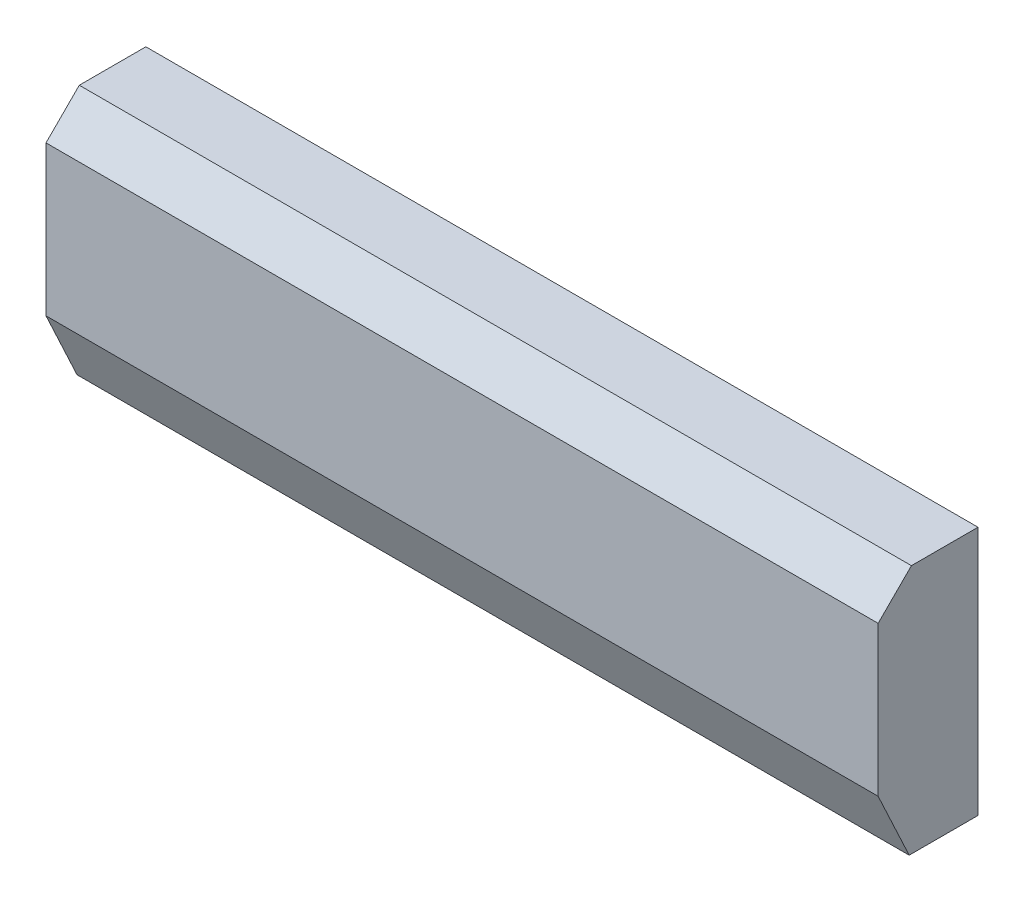
ISO-10303-21;
HEADER;
FILE_DESCRIPTION(('STEP AP214'),'2;1');
FILE_NAME('part.step','',(''),(''),'','','');
FILE_SCHEMA(('AUTOMOTIVE_DESIGN { 1 0 10303 214 1 1 1 1 }'));
ENDSEC;
DATA;
#1=APPLICATION_CONTEXT('core data for automotive mechanical design processes');
#2=APPLICATION_PROTOCOL_DEFINITION('international standard','automotive_design',2000,#1);
#3=PRODUCT_CONTEXT('',#1,'mechanical');
#4=PRODUCT('Part','Part','',(#3));
#5=PRODUCT_RELATED_PRODUCT_CATEGORY('part','',(#4));
#6=PRODUCT_DEFINITION_FORMATION('','',#4);
#7=PRODUCT_DEFINITION_CONTEXT('part definition',#1,'design');
#8=PRODUCT_DEFINITION('design','',#6,#7);
#9=PRODUCT_DEFINITION_SHAPE('','',#8);
#10=(LENGTH_UNIT() NAMED_UNIT(*) SI_UNIT(.MILLI.,.METRE.));
#11=(NAMED_UNIT(*) PLANE_ANGLE_UNIT() SI_UNIT($,.RADIAN.));
#12=(NAMED_UNIT(*) SI_UNIT($,.STERADIAN.) SOLID_ANGLE_UNIT());
#13=UNCERTAINTY_MEASURE_WITH_UNIT(LENGTH_MEASURE(1.E-05),#10,'distance_accuracy_value','');
#14=(GEOMETRIC_REPRESENTATION_CONTEXT(3) GLOBAL_UNCERTAINTY_ASSIGNED_CONTEXT((#13)) GLOBAL_UNIT_ASSIGNED_CONTEXT((#10,
#11,#12)) REPRESENTATION_CONTEXT('',''));
#15=CARTESIAN_POINT('',(0.,0.,0.));
#16=DIRECTION('',(0.,0.,1.));
#17=DIRECTION('',(1.,0.,0.));
#18=AXIS2_PLACEMENT_3D('',#15,#16,#17);
#19=CARTESIAN_POINT('',(-12.5,-3.5,3.));
#20=DIRECTION('',(1.,0.,0.));
#21=DIRECTION('',(0.,0.,-1.));
#22=AXIS2_PLACEMENT_3D('',#19,#20,#21);
#23=PLANE('',#22);
#24=DIRECTION('',(0.,0.,-1.));
#25=VECTOR('',#24,1.);
#26=CARTESIAN_POINT('',(-12.5,-3.5,3.));
#27=LINE('',#26,#25);
#28=CARTESIAN_POINT('',(-12.5,-3.5,2.06738468369));
#29=VERTEX_POINT('',#28);
#30=CARTESIAN_POINT('',(-12.5,-3.5,0.));
#31=VERTEX_POINT('',#30);
#32=EDGE_CURVE('E81',#29,#31,#27,.T.);
#33=ORIENTED_EDGE('',*,*,#32,.F.);
#34=DIRECTION('',(0.,-0.906307787036651,-0.422618261740697));
#35=VECTOR('',#34,1.);
#36=CARTESIAN_POINT('',(-12.5,-1.49999999999998,3.));
#37=LINE('',#36,#35);
#38=CARTESIAN_POINT('',(-12.5,-1.49999999999999,3.));
#39=VERTEX_POINT('',#38);
#40=EDGE_CURVE('E11',#29,#39,#37,.F.);
#41=ORIENTED_EDGE('',*,*,#40,.T.);
#42=DIRECTION('',(0.,-1.,0.));
#43=VECTOR('',#42,1.);
#44=CARTESIAN_POINT('',(-12.5,-3.5,3.));
#45=LINE('',#44,#43);
#46=CARTESIAN_POINT('',(-12.5,2.99999999999999,3.));
#47=VERTEX_POINT('',#46);
#48=EDGE_CURVE('E111',#47,#39,#45,.T.);
#49=ORIENTED_EDGE('',*,*,#48,.F.);
#50=DIRECTION('',(0.,-0.707106781186546,0.707106781186549));
#51=VECTOR('',#50,1.);
#52=CARTESIAN_POINT('',(-12.5,3.,3.));
#53=LINE('',#52,#51);
#54=CARTESIAN_POINT('',(-12.5,4.,2.));
#55=VERTEX_POINT('',#54);
#56=EDGE_CURVE('E118',#47,#55,#53,.F.);
#57=ORIENTED_EDGE('',*,*,#56,.T.);
#58=DIRECTION('',(0.,0.,-1.));
#59=VECTOR('',#58,1.);
#60=CARTESIAN_POINT('',(-12.5,4.,3.));
#61=LINE('',#60,#59);
#62=CARTESIAN_POINT('',(-12.5,4.,0.));
#63=VERTEX_POINT('',#62);
#64=EDGE_CURVE('E101',#55,#63,#61,.T.);
#65=ORIENTED_EDGE('',*,*,#64,.T.);
#66=DIRECTION('',(0.,-1.,0.));
#67=VECTOR('',#66,1.);
#68=CARTESIAN_POINT('',(-12.5,-3.5,0.));
#69=LINE('',#68,#67);
#70=EDGE_CURVE('E96',#63,#31,#69,.T.);
#71=ORIENTED_EDGE('',*,*,#70,.T.);
#72=EDGE_LOOP('',(#33,#41,#49,#57,#65,#71));
#73=FACE_BOUND('',#72,.T.);
#74=ADVANCED_FACE('F32',(#73),#23,.F.);
#75=CARTESIAN_POINT('',(-12.5,-3.5,3.));
#76=DIRECTION('',(0.,1.,0.));
#77=DIRECTION('',(0.,0.,1.));
#78=AXIS2_PLACEMENT_3D('',#75,#76,#77);
#79=PLANE('',#78);
#80=DIRECTION('',(0.,0.,-1.));
#81=VECTOR('',#80,1.);
#82=CARTESIAN_POINT('',(12.5,-3.5,3.));
#83=LINE('',#82,#81);
#84=CARTESIAN_POINT('',(12.5,-3.5,2.06738468369));
#85=VERTEX_POINT('',#84);
#86=CARTESIAN_POINT('',(12.5,-3.5,0.));
#87=VERTEX_POINT('',#86);
#88=EDGE_CURVE('E90',#85,#87,#83,.T.);
#89=ORIENTED_EDGE('',*,*,#88,.F.);
#90=DIRECTION('',(-1.,0.,0.));
#91=VECTOR('',#90,1.);
#92=CARTESIAN_POINT('',(-12.5,-3.5,2.06738468369));
#93=LINE('',#92,#91);
#94=EDGE_CURVE('E40',#85,#29,#93,.T.);
#95=ORIENTED_EDGE('',*,*,#94,.T.);
#96=ORIENTED_EDGE('',*,*,#32,.T.);
#97=DIRECTION('',(1.,0.,0.));
#98=VECTOR('',#97,1.);
#99=CARTESIAN_POINT('',(-12.5,-3.5,0.));
#100=LINE('',#99,#98);
#101=EDGE_CURVE('E84',#31,#87,#100,.T.);
#102=ORIENTED_EDGE('',*,*,#101,.T.);
#103=EDGE_LOOP('',(#89,#95,#96,#102));
#104=FACE_BOUND('',#103,.T.);
#105=ADVANCED_FACE('F83',(#104),#79,.F.);
#106=CARTESIAN_POINT('',(12.5,-3.5,3.));
#107=DIRECTION('',(-1.,0.,0.));
#108=DIRECTION('',(0.,0.,1.));
#109=AXIS2_PLACEMENT_3D('',#106,#107,#108);
#110=PLANE('',#109);
#111=DIRECTION('',(0.,1.,0.));
#112=VECTOR('',#111,1.);
#113=CARTESIAN_POINT('',(12.5,-3.5,3.));
#114=LINE('',#113,#112);
#115=CARTESIAN_POINT('',(12.5,-1.49999999999999,3.));
#116=VERTEX_POINT('',#115);
#117=CARTESIAN_POINT('',(12.5,2.99999999999999,3.));
#118=VERTEX_POINT('',#117);
#119=EDGE_CURVE('E105',#116,#118,#114,.T.);
#120=ORIENTED_EDGE('',*,*,#119,.F.);
#121=DIRECTION('',(0.,0.906307787036651,0.422618261740697));
#122=VECTOR('',#121,1.);
#123=CARTESIAN_POINT('',(12.5,-1.49999999999998,3.));
#124=LINE('',#123,#122);
#125=EDGE_CURVE('E54',#116,#85,#124,.F.);
#126=ORIENTED_EDGE('',*,*,#125,.T.);
#127=ORIENTED_EDGE('',*,*,#88,.T.);
#128=DIRECTION('',(0.,1.,0.));
#129=VECTOR('',#128,1.);
#130=CARTESIAN_POINT('',(12.5,-3.5,0.));
#131=LINE('',#130,#129);
#132=CARTESIAN_POINT('',(12.5,4.,0.));
#133=VERTEX_POINT('',#132);
#134=EDGE_CURVE('E98',#87,#133,#131,.T.);
#135=ORIENTED_EDGE('',*,*,#134,.T.);
#136=DIRECTION('',(0.,0.,-1.));
#137=VECTOR('',#136,1.);
#138=CARTESIAN_POINT('',(12.5,4.,3.));
#139=LINE('',#138,#137);
#140=CARTESIAN_POINT('',(12.5,4.,2.));
#141=VERTEX_POINT('',#140);
#142=EDGE_CURVE('E113',#141,#133,#139,.T.);
#143=ORIENTED_EDGE('',*,*,#142,.F.);
#144=DIRECTION('',(0.,0.707106781186546,-0.707106781186549));
#145=VECTOR('',#144,1.);
#146=CARTESIAN_POINT('',(12.5,3.,3.));
#147=LINE('',#146,#145);
#148=EDGE_CURVE('E122',#141,#118,#147,.F.);
#149=ORIENTED_EDGE('',*,*,#148,.T.);
#150=EDGE_LOOP('',(#120,#126,#127,#135,#143,#149));
#151=FACE_BOUND('',#150,.T.);
#152=ADVANCED_FACE('F134',(#151),#110,.F.);
#153=CARTESIAN_POINT('',(-12.5,4.,3.));
#154=DIRECTION('',(0.,-1.,0.));
#155=DIRECTION('',(0.,0.,-1.));
#156=AXIS2_PLACEMENT_3D('',#153,#154,#155);
#157=PLANE('',#156);
#158=ORIENTED_EDGE('',*,*,#64,.F.);
#159=DIRECTION('',(1.,0.,0.));
#160=VECTOR('',#159,1.);
#161=CARTESIAN_POINT('',(-12.5,4.,2.));
#162=LINE('',#161,#160);
#163=EDGE_CURVE('E120',#55,#141,#162,.T.);
#164=ORIENTED_EDGE('',*,*,#163,.T.);
#165=ORIENTED_EDGE('',*,*,#142,.T.);
#166=DIRECTION('',(-1.,0.,0.));
#167=VECTOR('',#166,1.);
#168=CARTESIAN_POINT('',(-12.5,4.,0.));
#169=LINE('',#168,#167);
#170=EDGE_CURVE('E109',#133,#63,#169,.T.);
#171=ORIENTED_EDGE('',*,*,#170,.T.);
#172=EDGE_LOOP('',(#158,#164,#165,#171));
#173=FACE_BOUND('',#172,.T.);
#174=ADVANCED_FACE('F154',(#173),#157,.F.);
#175=CARTESIAN_POINT('',(-12.5,4.,3.));
#176=DIRECTION('',(0.,0.,-1.));
#177=DIRECTION('',(-1.,0.,0.));
#178=AXIS2_PLACEMENT_3D('',#175,#176,#177);
#179=PLANE('',#178);
#180=ORIENTED_EDGE('',*,*,#48,.T.);
#181=DIRECTION('',(1.,0.,0.));
#182=VECTOR('',#181,1.);
#183=CARTESIAN_POINT('',(-12.5,-1.49999999999998,3.));
#184=LINE('',#183,#182);
#185=EDGE_CURVE('E125',#39,#116,#184,.T.);
#186=ORIENTED_EDGE('',*,*,#185,.T.);
#187=ORIENTED_EDGE('',*,*,#119,.T.);
#188=DIRECTION('',(-1.,0.,0.));
#189=VECTOR('',#188,1.);
#190=CARTESIAN_POINT('',(-12.5,3.,3.));
#191=LINE('',#190,#189);
#192=EDGE_CURVE('E89',#118,#47,#191,.T.);
#193=ORIENTED_EDGE('',*,*,#192,.T.);
#194=EDGE_LOOP('',(#180,#186,#187,#193));
#195=FACE_BOUND('',#194,.T.);
#196=ADVANCED_FACE('F131',(#195),#179,.F.);
#197=CARTESIAN_POINT('',(-12.5,4.,0.));
#198=DIRECTION('',(0.,0.,-1.));
#199=DIRECTION('',(-1.,0.,0.));
#200=AXIS2_PLACEMENT_3D('',#197,#198,#199);
#201=PLANE('',#200);
#202=ORIENTED_EDGE('',*,*,#70,.F.);
#203=ORIENTED_EDGE('',*,*,#170,.F.);
#204=ORIENTED_EDGE('',*,*,#134,.F.);
#205=ORIENTED_EDGE('',*,*,#101,.F.);
#206=EDGE_LOOP('',(#202,#203,#204,#205));
#207=FACE_BOUND('',#206,.T.);
#208=ADVANCED_FACE('F94',(#207),#201,.T.);
#209=CARTESIAN_POINT('',(-12.5,3.,3.));
#210=DIRECTION('',(0.,-0.707106781186549,-0.707106781186546));
#211=DIRECTION('',(0.,0.707106781186546,-0.707106781186549));
#212=AXIS2_PLACEMENT_3D('',#209,#210,#211);
#213=PLANE('',#212);
#214=ORIENTED_EDGE('',*,*,#148,.F.);
#215=ORIENTED_EDGE('',*,*,#163,.F.);
#216=ORIENTED_EDGE('',*,*,#56,.F.);
#217=ORIENTED_EDGE('',*,*,#192,.F.);
#218=EDGE_LOOP('',(#214,#215,#216,#217));
#219=FACE_BOUND('',#218,.T.);
#220=ADVANCED_FACE('F140',(#219),#213,.F.);
#221=CARTESIAN_POINT('',(-12.5,-1.49999999999998,3.));
#222=DIRECTION('',(0.,0.422618261740697,-0.906307787036651));
#223=DIRECTION('',(0.,0.906307787036651,0.422618261740697));
#224=AXIS2_PLACEMENT_3D('',#221,#222,#223);
#225=PLANE('',#224);
#226=ORIENTED_EDGE('',*,*,#40,.F.);
#227=ORIENTED_EDGE('',*,*,#94,.F.);
#228=ORIENTED_EDGE('',*,*,#125,.F.);
#229=ORIENTED_EDGE('',*,*,#185,.F.);
#230=EDGE_LOOP('',(#226,#227,#228,#229));
#231=FACE_BOUND('',#230,.T.);
#232=ADVANCED_FACE('F34',(#231),#225,.F.);
#233=CLOSED_SHELL('',(#74,#105,#152,#174,#196,#208,#220,#232));
#234=MANIFOLD_SOLID_BREP('B2',#233);
#235=ADVANCED_BREP_SHAPE_REPRESENTATION('',(#18,#234),#14);
#236=SHAPE_DEFINITION_REPRESENTATION(#9,#235);
ENDSEC;
END-ISO-10303-21;
